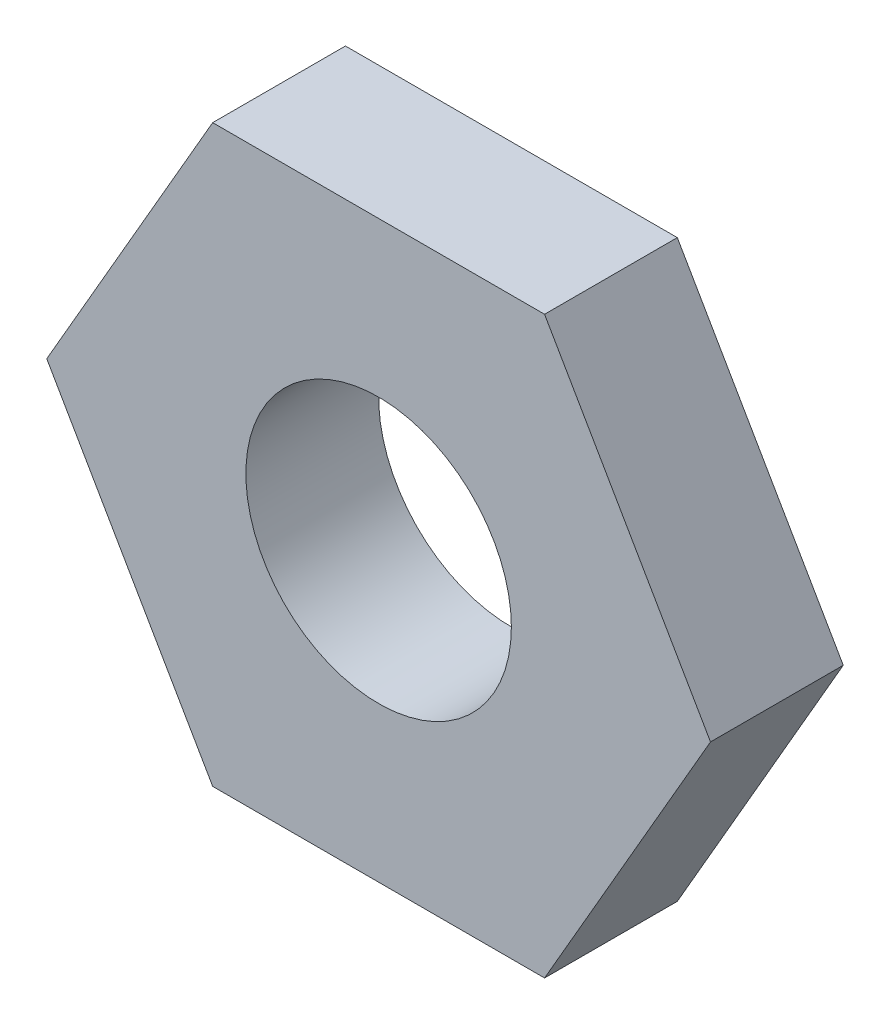
ISO-10303-21;
HEADER;
FILE_DESCRIPTION(('STEP AP214'),'2;1');
FILE_NAME('part.step','',(''),(''),'','','');
FILE_SCHEMA(('AUTOMOTIVE_DESIGN { 1 0 10303 214 1 1 1 1 }'));
ENDSEC;
DATA;
#1=APPLICATION_CONTEXT('core data for automotive mechanical design processes');
#2=APPLICATION_PROTOCOL_DEFINITION('international standard','automotive_design',2000,#1);
#3=PRODUCT_CONTEXT('',#1,'mechanical');
#4=PRODUCT('Part','Part','',(#3));
#5=PRODUCT_RELATED_PRODUCT_CATEGORY('part','',(#4));
#6=PRODUCT_DEFINITION_FORMATION('','',#4);
#7=PRODUCT_DEFINITION_CONTEXT('part definition',#1,'design');
#8=PRODUCT_DEFINITION('design','',#6,#7);
#9=PRODUCT_DEFINITION_SHAPE('','',#8);
#10=(LENGTH_UNIT() NAMED_UNIT(*) SI_UNIT(.MILLI.,.METRE.));
#11=(NAMED_UNIT(*) PLANE_ANGLE_UNIT() SI_UNIT($,.RADIAN.));
#12=(NAMED_UNIT(*) SI_UNIT($,.STERADIAN.) SOLID_ANGLE_UNIT());
#13=UNCERTAINTY_MEASURE_WITH_UNIT(LENGTH_MEASURE(1.E-05),#10,'distance_accuracy_value','');
#14=(GEOMETRIC_REPRESENTATION_CONTEXT(3) GLOBAL_UNCERTAINTY_ASSIGNED_CONTEXT((#13)) GLOBAL_UNIT_ASSIGNED_CONTEXT((#10,
#11,#12)) REPRESENTATION_CONTEXT('',''));
#15=CARTESIAN_POINT('',(0.,0.,0.));
#16=DIRECTION('',(0.,0.,1.));
#17=DIRECTION('',(1.,0.,0.));
#18=AXIS2_PLACEMENT_3D('',#15,#16,#17);
#19=CARTESIAN_POINT('',(-5.,8.66025403784439,4.));
#20=DIRECTION('',(0.866025403784439,-0.5,0.));
#21=DIRECTION('',(0.5,0.866025403784439,0.));
#22=AXIS2_PLACEMENT_3D('',#19,#20,#21);
#23=PLANE('',#22);
#24=DIRECTION('',(-0.5,-0.866025403784439,0.));
#25=VECTOR('',#24,1.);
#26=CARTESIAN_POINT('',(-5.,8.66025403784439,0.));
#27=LINE('',#26,#25);
#28=CARTESIAN_POINT('',(-5.,8.66025403784439,0.));
#29=VERTEX_POINT('',#28);
#30=CARTESIAN_POINT('',(-10.,0.,0.));
#31=VERTEX_POINT('',#30);
#32=EDGE_CURVE('E119',#29,#31,#27,.T.);
#33=ORIENTED_EDGE('',*,*,#32,.T.);
#34=DIRECTION('',(0.,0.,-1.));
#35=VECTOR('',#34,1.);
#36=CARTESIAN_POINT('',(-10.,0.,4.));
#37=LINE('',#36,#35);
#38=CARTESIAN_POINT('',(-10.,0.,4.));
#39=VERTEX_POINT('',#38);
#40=EDGE_CURVE('E11',#39,#31,#37,.T.);
#41=ORIENTED_EDGE('',*,*,#40,.F.);
#42=DIRECTION('',(-0.5,-0.866025403784439,0.));
#43=VECTOR('',#42,1.);
#44=CARTESIAN_POINT('',(-5.,8.66025403784439,4.));
#45=LINE('',#44,#43);
#46=CARTESIAN_POINT('',(-5.,8.66025403784439,4.));
#47=VERTEX_POINT('',#46);
#48=EDGE_CURVE('E130',#47,#39,#45,.T.);
#49=ORIENTED_EDGE('',*,*,#48,.F.);
#50=DIRECTION('',(0.,0.,-1.));
#51=VECTOR('',#50,1.);
#52=CARTESIAN_POINT('',(-5.,8.66025403784439,4.));
#53=LINE('',#52,#51);
#54=EDGE_CURVE('E115',#47,#29,#53,.T.);
#55=ORIENTED_EDGE('',*,*,#54,.T.);
#56=EDGE_LOOP('',(#33,#41,#49,#55));
#57=FACE_BOUND('',#56,.T.);
#58=ADVANCED_FACE('F35',(#57),#23,.F.);
#59=CARTESIAN_POINT('',(-10.,0.,4.));
#60=DIRECTION('',(0.866025403784438,0.5,0.));
#61=DIRECTION('',(-0.5,0.866025403784439,0.));
#62=AXIS2_PLACEMENT_3D('',#59,#60,#61);
#63=PLANE('',#62);
#64=DIRECTION('',(0.5,-0.866025403784438,0.));
#65=VECTOR('',#64,1.);
#66=CARTESIAN_POINT('',(-10.,0.,0.));
#67=LINE('',#66,#65);
#68=CARTESIAN_POINT('',(-4.99999999999999,-8.66025403784439,0.));
#69=VERTEX_POINT('',#68);
#70=EDGE_CURVE('E122',#31,#69,#67,.T.);
#71=ORIENTED_EDGE('',*,*,#70,.T.);
#72=DIRECTION('',(0.,0.,-1.));
#73=VECTOR('',#72,1.);
#74=CARTESIAN_POINT('',(-4.99999999999999,-8.66025403784439,4.));
#75=LINE('',#74,#73);
#76=CARTESIAN_POINT('',(-4.99999999999999,-8.66025403784439,4.));
#77=VERTEX_POINT('',#76);
#78=EDGE_CURVE('E43',#77,#69,#75,.T.);
#79=ORIENTED_EDGE('',*,*,#78,.F.);
#80=DIRECTION('',(0.5,-0.866025403784438,0.));
#81=VECTOR('',#80,1.);
#82=CARTESIAN_POINT('',(-10.,0.,4.));
#83=LINE('',#82,#81);
#84=EDGE_CURVE('E88',#39,#77,#83,.T.);
#85=ORIENTED_EDGE('',*,*,#84,.F.);
#86=ORIENTED_EDGE('',*,*,#40,.T.);
#87=EDGE_LOOP('',(#71,#79,#85,#86));
#88=FACE_BOUND('',#87,.T.);
#89=ADVANCED_FACE('F155',(#88),#63,.F.);
#90=CARTESIAN_POINT('',(-4.99999999999999,-8.66025403784439,4.));
#91=DIRECTION('',(0.,1.,0.));
#92=DIRECTION('',(0.,0.,1.));
#93=AXIS2_PLACEMENT_3D('',#90,#91,#92);
#94=PLANE('',#93);
#95=DIRECTION('',(1.,0.,0.));
#96=VECTOR('',#95,1.);
#97=CARTESIAN_POINT('',(-4.99999999999999,-8.66025403784439,0.));
#98=LINE('',#97,#96);
#99=CARTESIAN_POINT('',(5.,-8.66025403784439,0.));
#100=VERTEX_POINT('',#99);
#101=EDGE_CURVE('E125',#69,#100,#98,.T.);
#102=ORIENTED_EDGE('',*,*,#101,.T.);
#103=DIRECTION('',(0.,0.,-1.));
#104=VECTOR('',#103,1.);
#105=CARTESIAN_POINT('',(5.,-8.66025403784439,4.));
#106=LINE('',#105,#104);
#107=CARTESIAN_POINT('',(5.,-8.66025403784439,4.));
#108=VERTEX_POINT('',#107);
#109=EDGE_CURVE('E110',#108,#100,#106,.T.);
#110=ORIENTED_EDGE('',*,*,#109,.F.);
#111=DIRECTION('',(1.,0.,0.));
#112=VECTOR('',#111,1.);
#113=CARTESIAN_POINT('',(-4.99999999999999,-8.66025403784439,4.));
#114=LINE('',#113,#112);
#115=EDGE_CURVE('E101',#77,#108,#114,.T.);
#116=ORIENTED_EDGE('',*,*,#115,.F.);
#117=ORIENTED_EDGE('',*,*,#78,.T.);
#118=EDGE_LOOP('',(#102,#110,#116,#117));
#119=FACE_BOUND('',#118,.T.);
#120=ADVANCED_FACE('F136',(#119),#94,.F.);
#121=CARTESIAN_POINT('',(5.,-8.66025403784439,4.));
#122=DIRECTION('',(-0.866025403784439,0.5,0.));
#123=DIRECTION('',(-0.5,-0.866025403784439,0.));
#124=AXIS2_PLACEMENT_3D('',#121,#122,#123);
#125=PLANE('',#124);
#126=DIRECTION('',(0.5,0.866025403784439,0.));
#127=VECTOR('',#126,1.);
#128=CARTESIAN_POINT('',(5.,-8.66025403784439,0.));
#129=LINE('',#128,#127);
#130=CARTESIAN_POINT('',(10.,0.,0.));
#131=VERTEX_POINT('',#130);
#132=EDGE_CURVE('E109',#100,#131,#129,.T.);
#133=ORIENTED_EDGE('',*,*,#132,.T.);
#134=DIRECTION('',(0.,0.,-1.));
#135=VECTOR('',#134,1.);
#136=CARTESIAN_POINT('',(10.,0.,4.));
#137=LINE('',#136,#135);
#138=CARTESIAN_POINT('',(10.,0.,4.));
#139=VERTEX_POINT('',#138);
#140=EDGE_CURVE('E106',#139,#131,#137,.T.);
#141=ORIENTED_EDGE('',*,*,#140,.F.);
#142=DIRECTION('',(0.5,0.866025403784439,0.));
#143=VECTOR('',#142,1.);
#144=CARTESIAN_POINT('',(5.,-8.66025403784439,4.));
#145=LINE('',#144,#143);
#146=EDGE_CURVE('E95',#108,#139,#145,.T.);
#147=ORIENTED_EDGE('',*,*,#146,.F.);
#148=ORIENTED_EDGE('',*,*,#109,.T.);
#149=EDGE_LOOP('',(#133,#141,#147,#148));
#150=FACE_BOUND('',#149,.T.);
#151=ADVANCED_FACE('F107',(#150),#125,.F.);
#152=CARTESIAN_POINT('',(10.,0.,4.));
#153=DIRECTION('',(-0.866025403784439,-0.5,0.));
#154=DIRECTION('',(0.5,-0.866025403784439,0.));
#155=AXIS2_PLACEMENT_3D('',#152,#153,#154);
#156=PLANE('',#155);
#157=DIRECTION('',(-0.5,0.866025403784439,0.));
#158=VECTOR('',#157,1.);
#159=CARTESIAN_POINT('',(10.,0.,0.));
#160=LINE('',#159,#158);
#161=CARTESIAN_POINT('',(5.,8.66025403784439,0.));
#162=VERTEX_POINT('',#161);
#163=EDGE_CURVE('E74',#131,#162,#160,.T.);
#164=ORIENTED_EDGE('',*,*,#163,.T.);
#165=DIRECTION('',(0.,0.,-1.));
#166=VECTOR('',#165,1.);
#167=CARTESIAN_POINT('',(5.,8.66025403784439,4.));
#168=LINE('',#167,#166);
#169=CARTESIAN_POINT('',(5.,8.66025403784439,4.));
#170=VERTEX_POINT('',#169);
#171=EDGE_CURVE('E111',#170,#162,#168,.T.);
#172=ORIENTED_EDGE('',*,*,#171,.F.);
#173=DIRECTION('',(-0.5,0.866025403784439,0.));
#174=VECTOR('',#173,1.);
#175=CARTESIAN_POINT('',(10.,0.,4.));
#176=LINE('',#175,#174);
#177=EDGE_CURVE('E99',#139,#170,#176,.T.);
#178=ORIENTED_EDGE('',*,*,#177,.F.);
#179=ORIENTED_EDGE('',*,*,#140,.T.);
#180=EDGE_LOOP('',(#164,#172,#178,#179));
#181=FACE_BOUND('',#180,.T.);
#182=ADVANCED_FACE('F113',(#181),#156,.F.);
#183=CARTESIAN_POINT('',(5.,8.66025403784439,4.));
#184=DIRECTION('',(0.,-1.,0.));
#185=DIRECTION('',(0.,0.,-1.));
#186=AXIS2_PLACEMENT_3D('',#183,#184,#185);
#187=PLANE('',#186);
#188=DIRECTION('',(-1.,0.,0.));
#189=VECTOR('',#188,1.);
#190=CARTESIAN_POINT('',(5.,8.66025403784439,0.));
#191=LINE('',#190,#189);
#192=EDGE_CURVE('E80',#162,#29,#191,.T.);
#193=ORIENTED_EDGE('',*,*,#192,.T.);
#194=ORIENTED_EDGE('',*,*,#54,.F.);
#195=DIRECTION('',(-1.,0.,0.));
#196=VECTOR('',#195,1.);
#197=CARTESIAN_POINT('',(5.,8.66025403784439,4.));
#198=LINE('',#197,#196);
#199=EDGE_CURVE('E51',#170,#47,#198,.T.);
#200=ORIENTED_EDGE('',*,*,#199,.F.);
#201=ORIENTED_EDGE('',*,*,#171,.T.);
#202=EDGE_LOOP('',(#193,#194,#200,#201));
#203=FACE_BOUND('',#202,.T.);
#204=ADVANCED_FACE('F143',(#203),#187,.F.);
#205=CARTESIAN_POINT('',(0.,0.,4.));
#206=DIRECTION('',(0.,0.,1.));
#207=DIRECTION('',(1.,0.,0.));
#208=AXIS2_PLACEMENT_3D('',#205,#206,#207);
#209=PLANE('',#208);
#210=CARTESIAN_POINT('',(0.,0.,4.));
#211=DIRECTION('',(0.,0.,1.));
#212=DIRECTION('',(1.,0.,0.));
#213=AXIS2_PLACEMENT_3D('',#210,#211,#212);
#214=CIRCLE('',#213,4.);
#215=CARTESIAN_POINT('',(4.,0.,4.));
#216=VERTEX_POINT('',#215);
#217=EDGE_CURVE('E210',#216,#216,#214,.T.);
#218=ORIENTED_EDGE('',*,*,#217,.F.);
#219=EDGE_LOOP('',(#218));
#220=FACE_BOUND('',#219,.T.);
#221=ORIENTED_EDGE('',*,*,#48,.T.);
#222=ORIENTED_EDGE('',*,*,#84,.T.);
#223=ORIENTED_EDGE('',*,*,#115,.T.);
#224=ORIENTED_EDGE('',*,*,#146,.T.);
#225=ORIENTED_EDGE('',*,*,#177,.T.);
#226=ORIENTED_EDGE('',*,*,#199,.T.);
#227=EDGE_LOOP('',(#221,#222,#223,#224,#225,#226));
#228=FACE_BOUND('',#227,.T.);
#229=ADVANCED_FACE('F97',(#220,#228),#209,.T.);
#230=CARTESIAN_POINT('',(0.,0.,0.));
#231=DIRECTION('',(0.,0.,1.));
#232=DIRECTION('',(1.,0.,0.));
#233=AXIS2_PLACEMENT_3D('',#230,#231,#232);
#234=PLANE('',#233);
#235=CARTESIAN_POINT('',(0.,0.,0.));
#236=DIRECTION('',(0.,0.,1.));
#237=DIRECTION('',(1.,0.,0.));
#238=AXIS2_PLACEMENT_3D('',#235,#236,#237);
#239=CIRCLE('',#238,4.);
#240=CARTESIAN_POINT('',(4.,0.,0.));
#241=VERTEX_POINT('',#240);
#242=EDGE_CURVE('E123',#241,#241,#239,.T.);
#243=ORIENTED_EDGE('',*,*,#242,.T.);
#244=EDGE_LOOP('',(#243));
#245=FACE_BOUND('',#244,.T.);
#246=ORIENTED_EDGE('',*,*,#32,.F.);
#247=ORIENTED_EDGE('',*,*,#192,.F.);
#248=ORIENTED_EDGE('',*,*,#163,.F.);
#249=ORIENTED_EDGE('',*,*,#132,.F.);
#250=ORIENTED_EDGE('',*,*,#101,.F.);
#251=ORIENTED_EDGE('',*,*,#70,.F.);
#252=EDGE_LOOP('',(#246,#247,#248,#249,#250,#251));
#253=FACE_BOUND('',#252,.T.);
#254=ADVANCED_FACE('F139',(#245,#253),#234,.F.);
#255=CARTESIAN_POINT('',(0.,0.,0.));
#256=DIRECTION('',(0.,0.,1.));
#257=DIRECTION('',(1.,0.,0.));
#258=AXIS2_PLACEMENT_3D('',#255,#256,#257);
#259=CYLINDRICAL_SURFACE('',#258,4.);
#260=ORIENTED_EDGE('',*,*,#242,.F.);
#261=EDGE_LOOP('',(#260));
#262=FACE_BOUND('',#261,.T.);
#263=ORIENTED_EDGE('',*,*,#217,.T.);
#264=EDGE_LOOP('',(#263));
#265=FACE_BOUND('',#264,.T.);
#266=ADVANCED_FACE('F192',(#262,#265),#259,.F.);
#267=CLOSED_SHELL('',(#58,#89,#120,#151,#182,#204,#229,#254,#266));
#268=MANIFOLD_SOLID_BREP('B2',#267);
#269=ADVANCED_BREP_SHAPE_REPRESENTATION('',(#18,#268),#14);
#270=SHAPE_DEFINITION_REPRESENTATION(#9,#269);
ENDSEC;
END-ISO-10303-21;
